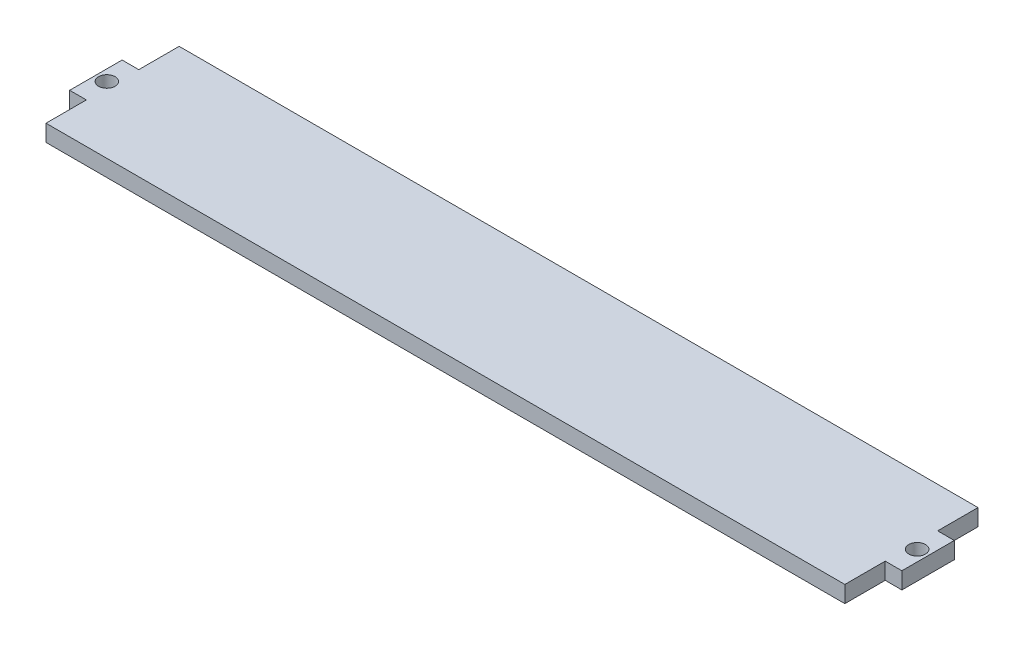
ISO-10303-21;
HEADER;
FILE_DESCRIPTION(('STEP AP214'),'2;1');
FILE_NAME('part.step','',(''),(''),'','','');
FILE_SCHEMA(('AUTOMOTIVE_DESIGN { 1 0 10303 214 1 1 1 1 }'));
ENDSEC;
DATA;
#1=APPLICATION_CONTEXT('core data for automotive mechanical design processes');
#2=APPLICATION_PROTOCOL_DEFINITION('international standard','automotive_design',2000,#1);
#3=PRODUCT_CONTEXT('',#1,'mechanical');
#4=PRODUCT('Part','Part','',(#3));
#5=PRODUCT_RELATED_PRODUCT_CATEGORY('part','',(#4));
#6=PRODUCT_DEFINITION_FORMATION('','',#4);
#7=PRODUCT_DEFINITION_CONTEXT('part definition',#1,'design');
#8=PRODUCT_DEFINITION('design','',#6,#7);
#9=PRODUCT_DEFINITION_SHAPE('','',#8);
#10=(LENGTH_UNIT() NAMED_UNIT(*) SI_UNIT(.MILLI.,.METRE.));
#11=(NAMED_UNIT(*) PLANE_ANGLE_UNIT() SI_UNIT($,.RADIAN.));
#12=(NAMED_UNIT(*) SI_UNIT($,.STERADIAN.) SOLID_ANGLE_UNIT());
#13=UNCERTAINTY_MEASURE_WITH_UNIT(LENGTH_MEASURE(1.E-05),#10,'distance_accuracy_value','');
#14=(GEOMETRIC_REPRESENTATION_CONTEXT(3) GLOBAL_UNCERTAINTY_ASSIGNED_CONTEXT((#13)) GLOBAL_UNIT_ASSIGNED_CONTEXT((#10,
#11,#12)) REPRESENTATION_CONTEXT('',''));
#15=CARTESIAN_POINT('',(0.,0.,0.));
#16=DIRECTION('',(0.,0.,1.));
#17=DIRECTION('',(1.,0.,0.));
#18=AXIS2_PLACEMENT_3D('',#15,#16,#17);
#19=CARTESIAN_POINT('',(76.2,3.18,-12.7));
#20=DIRECTION('',(-1.,0.,0.));
#21=DIRECTION('',(0.,0.,1.));
#22=AXIS2_PLACEMENT_3D('',#19,#20,#21);
#23=PLANE('',#22);
#24=DIRECTION('',(0.,1.,0.));
#25=VECTOR('',#24,1.);
#26=CARTESIAN_POINT('',(76.2,3.18,-5.));
#27=LINE('',#26,#25);
#28=CARTESIAN_POINT('',(76.2,0.,-5.));
#29=VERTEX_POINT('',#28);
#30=CARTESIAN_POINT('',(76.2,3.18,-5.));
#31=VERTEX_POINT('',#30);
#32=EDGE_CURVE('E154',#29,#31,#27,.T.);
#33=ORIENTED_EDGE('',*,*,#32,.F.);
#34=DIRECTION('',(0.,0.,-1.));
#35=VECTOR('',#34,1.);
#36=CARTESIAN_POINT('',(76.2,0.,-12.7));
#37=LINE('',#36,#35);
#38=CARTESIAN_POINT('',(76.2,0.,-12.7));
#39=VERTEX_POINT('',#38);
#40=EDGE_CURVE('E220',#29,#39,#37,.T.);
#41=ORIENTED_EDGE('',*,*,#40,.T.);
#42=DIRECTION('',(0.,-1.,0.));
#43=VECTOR('',#42,1.);
#44=CARTESIAN_POINT('',(76.2,3.18,-12.7));
#45=LINE('',#44,#43);
#46=CARTESIAN_POINT('',(76.2,3.18,-12.7));
#47=VERTEX_POINT('',#46);
#48=EDGE_CURVE('E230',#47,#39,#45,.T.);
#49=ORIENTED_EDGE('',*,*,#48,.F.);
#50=DIRECTION('',(0.,0.,-1.));
#51=VECTOR('',#50,1.);
#52=CARTESIAN_POINT('',(76.2,3.18,-12.7));
#53=LINE('',#52,#51);
#54=EDGE_CURVE('E55',#31,#47,#53,.T.);
#55=ORIENTED_EDGE('',*,*,#54,.F.);
#56=EDGE_LOOP('',(#33,#41,#49,#55));
#57=FACE_BOUND('',#56,.T.);
#58=ADVANCED_FACE('F39',(#57),#23,.F.);
#59=DIRECTION('',(0.,-1.,0.));
#60=VECTOR('',#59,1.);
#61=CARTESIAN_POINT('',(76.2,3.18,5.));
#62=LINE('',#61,#60);
#63=CARTESIAN_POINT('',(76.2,3.18,5.));
#64=VERTEX_POINT('',#63);
#65=CARTESIAN_POINT('',(76.2,0.,5.));
#66=VERTEX_POINT('',#65);
#67=EDGE_CURVE('E63',#64,#66,#62,.T.);
#68=ORIENTED_EDGE('',*,*,#67,.F.);
#69=CARTESIAN_POINT('',(76.2,3.18,12.7));
#70=VERTEX_POINT('',#69);
#71=EDGE_CURVE('E207',#70,#64,#53,.T.);
#72=ORIENTED_EDGE('',*,*,#71,.F.);
#73=DIRECTION('',(0.,-1.,0.));
#74=VECTOR('',#73,1.);
#75=CARTESIAN_POINT('',(76.2,3.18,12.7));
#76=LINE('',#75,#74);
#77=CARTESIAN_POINT('',(76.2,0.,12.7));
#78=VERTEX_POINT('',#77);
#79=EDGE_CURVE('E48',#70,#78,#76,.T.);
#80=ORIENTED_EDGE('',*,*,#79,.T.);
#81=EDGE_CURVE('E221',#78,#66,#37,.T.);
#82=ORIENTED_EDGE('',*,*,#81,.T.);
#83=EDGE_LOOP('',(#68,#72,#80,#82));
#84=FACE_BOUND('',#83,.T.);
#85=ADVANCED_FACE('F237',(#84),#23,.F.);
#86=CARTESIAN_POINT('',(-76.2,3.18,-12.7));
#87=DIRECTION('',(1.,0.,0.));
#88=DIRECTION('',(0.,0.,-1.));
#89=AXIS2_PLACEMENT_3D('',#86,#87,#88);
#90=PLANE('',#89);
#91=DIRECTION('',(0.,-1.,0.));
#92=VECTOR('',#91,1.);
#93=CARTESIAN_POINT('',(-76.2,3.18,-5.));
#94=LINE('',#93,#92);
#95=CARTESIAN_POINT('',(-76.2,3.18,-5.));
#96=VERTEX_POINT('',#95);
#97=CARTESIAN_POINT('',(-76.2,0.,-5.));
#98=VERTEX_POINT('',#97);
#99=EDGE_CURVE('E160',#96,#98,#94,.T.);
#100=ORIENTED_EDGE('',*,*,#99,.F.);
#101=DIRECTION('',(0.,0.,1.));
#102=VECTOR('',#101,1.);
#103=CARTESIAN_POINT('',(-76.2,3.18,-12.7));
#104=LINE('',#103,#102);
#105=CARTESIAN_POINT('',(-76.2,3.18,-12.7));
#106=VERTEX_POINT('',#105);
#107=EDGE_CURVE('E200',#106,#96,#104,.T.);
#108=ORIENTED_EDGE('',*,*,#107,.F.);
#109=DIRECTION('',(0.,-1.,0.));
#110=VECTOR('',#109,1.);
#111=CARTESIAN_POINT('',(-76.2,3.18,-12.7));
#112=LINE('',#111,#110);
#113=CARTESIAN_POINT('',(-76.2,0.,-12.7));
#114=VERTEX_POINT('',#113);
#115=EDGE_CURVE('E213',#106,#114,#112,.T.);
#116=ORIENTED_EDGE('',*,*,#115,.T.);
#117=DIRECTION('',(0.,0.,1.));
#118=VECTOR('',#117,1.);
#119=CARTESIAN_POINT('',(-76.2,0.,-12.7));
#120=LINE('',#119,#118);
#121=EDGE_CURVE('E214',#114,#98,#120,.T.);
#122=ORIENTED_EDGE('',*,*,#121,.T.);
#123=EDGE_LOOP('',(#100,#108,#116,#122));
#124=FACE_BOUND('',#123,.T.);
#125=ADVANCED_FACE('F307',(#124),#90,.F.);
#126=CARTESIAN_POINT('',(-76.2,3.18,5.));
#127=VERTEX_POINT('',#126);
#128=CARTESIAN_POINT('',(-76.2,3.18,12.7));
#129=VERTEX_POINT('',#128);
#130=EDGE_CURVE('E204',#127,#129,#104,.T.);
#131=ORIENTED_EDGE('',*,*,#130,.F.);
#132=DIRECTION('',(0.,-1.,0.));
#133=VECTOR('',#132,1.);
#134=CARTESIAN_POINT('',(-76.2,3.18,5.));
#135=LINE('',#134,#133);
#136=CARTESIAN_POINT('',(-76.2,0.,5.));
#137=VERTEX_POINT('',#136);
#138=EDGE_CURVE('E156',#127,#137,#135,.T.);
#139=ORIENTED_EDGE('',*,*,#138,.T.);
#140=CARTESIAN_POINT('',(-76.2,0.,12.7));
#141=VERTEX_POINT('',#140);
#142=EDGE_CURVE('E188',#137,#141,#120,.T.);
#143=ORIENTED_EDGE('',*,*,#142,.T.);
#144=DIRECTION('',(0.,-1.,0.));
#145=VECTOR('',#144,1.);
#146=CARTESIAN_POINT('',(-76.2,3.18,12.7));
#147=LINE('',#146,#145);
#148=EDGE_CURVE('E11',#129,#141,#147,.T.);
#149=ORIENTED_EDGE('',*,*,#148,.F.);
#150=EDGE_LOOP('',(#131,#139,#143,#149));
#151=FACE_BOUND('',#150,.T.);
#152=ADVANCED_FACE('F41',(#151),#90,.F.);
#153=CARTESIAN_POINT('',(76.2,3.18,12.7));
#154=DIRECTION('',(0.,0.,-1.));
#155=DIRECTION('',(-1.,0.,0.));
#156=AXIS2_PLACEMENT_3D('',#153,#154,#155);
#157=PLANE('',#156);
#158=DIRECTION('',(1.,0.,0.));
#159=VECTOR('',#158,1.);
#160=CARTESIAN_POINT('',(76.2,0.,12.7));
#161=LINE('',#160,#159);
#162=EDGE_CURVE('E217',#141,#78,#161,.T.);
#163=ORIENTED_EDGE('',*,*,#162,.T.);
#164=ORIENTED_EDGE('',*,*,#79,.F.);
#165=DIRECTION('',(1.,0.,0.));
#166=VECTOR('',#165,1.);
#167=CARTESIAN_POINT('',(76.2,3.18,12.7));
#168=LINE('',#167,#166);
#169=EDGE_CURVE('E203',#129,#70,#168,.T.);
#170=ORIENTED_EDGE('',*,*,#169,.F.);
#171=ORIENTED_EDGE('',*,*,#148,.T.);
#172=EDGE_LOOP('',(#163,#164,#170,#171));
#173=FACE_BOUND('',#172,.T.);
#174=ADVANCED_FACE('F310',(#173),#157,.F.);
#175=CARTESIAN_POINT('',(76.2,3.18,-12.7));
#176=DIRECTION('',(0.,0.,1.));
#177=DIRECTION('',(1.,0.,0.));
#178=AXIS2_PLACEMENT_3D('',#175,#176,#177);
#179=PLANE('',#178);
#180=DIRECTION('',(-1.,0.,0.));
#181=VECTOR('',#180,1.);
#182=CARTESIAN_POINT('',(76.2,0.,-12.7));
#183=LINE('',#182,#181);
#184=EDGE_CURVE('E224',#39,#114,#183,.T.);
#185=ORIENTED_EDGE('',*,*,#184,.T.);
#186=ORIENTED_EDGE('',*,*,#115,.F.);
#187=DIRECTION('',(-1.,0.,0.));
#188=VECTOR('',#187,1.);
#189=CARTESIAN_POINT('',(76.2,3.18,-12.7));
#190=LINE('',#189,#188);
#191=EDGE_CURVE('E210',#47,#106,#190,.T.);
#192=ORIENTED_EDGE('',*,*,#191,.F.);
#193=ORIENTED_EDGE('',*,*,#48,.T.);
#194=EDGE_LOOP('',(#185,#186,#192,#193));
#195=FACE_BOUND('',#194,.T.);
#196=ADVANCED_FACE('F289',(#195),#179,.F.);
#197=CARTESIAN_POINT('',(0.,3.18,0.));
#198=DIRECTION('',(0.,-1.,0.));
#199=DIRECTION('',(0.,0.,-1.));
#200=AXIS2_PLACEMENT_3D('',#197,#198,#199);
#201=PLANE('',#200);
#202=CARTESIAN_POINT('',(77.29,3.18,0.));
#203=DIRECTION('',(0.,1.,0.));
#204=DIRECTION('',(0.,0.,1.));
#205=AXIS2_PLACEMENT_3D('',#202,#203,#204);
#206=CIRCLE('',#205,1.59000000000001);
#207=CARTESIAN_POINT('',(77.29,3.18,1.59000000000001));
#208=VERTEX_POINT('',#207);
#209=EDGE_CURVE('E270',#208,#208,#206,.T.);
#210=ORIENTED_EDGE('',*,*,#209,.F.);
#211=EDGE_LOOP('',(#210));
#212=FACE_BOUND('',#211,.T.);
#213=CARTESIAN_POINT('',(-77.29,3.18,0.));
#214=DIRECTION('',(0.,1.,0.));
#215=DIRECTION('',(0.,0.,-1.));
#216=AXIS2_PLACEMENT_3D('',#213,#214,#215);
#217=CIRCLE('',#216,1.59000000000001);
#218=CARTESIAN_POINT('',(-77.29,3.18,-1.59000000000001));
#219=VERTEX_POINT('',#218);
#220=EDGE_CURVE('E262',#219,#219,#217,.T.);
#221=ORIENTED_EDGE('',*,*,#220,.F.);
#222=EDGE_LOOP('',(#221));
#223=FACE_BOUND('',#222,.T.);
#224=ORIENTED_EDGE('',*,*,#107,.T.);
#225=DIRECTION('',(1.,0.,0.));
#226=VECTOR('',#225,1.);
#227=CARTESIAN_POINT('',(-79.38,3.18,-5.));
#228=LINE('',#227,#226);
#229=CARTESIAN_POINT('',(-79.38,3.18,-5.));
#230=VERTEX_POINT('',#229);
#231=EDGE_CURVE('E184',#230,#96,#228,.T.);
#232=ORIENTED_EDGE('',*,*,#231,.F.);
#233=DIRECTION('',(0.,0.,1.));
#234=VECTOR('',#233,1.);
#235=CARTESIAN_POINT('',(-79.38,3.18,-5.));
#236=LINE('',#235,#234);
#237=CARTESIAN_POINT('',(-79.38,3.18,5.));
#238=VERTEX_POINT('',#237);
#239=EDGE_CURVE('E166',#230,#238,#236,.T.);
#240=ORIENTED_EDGE('',*,*,#239,.T.);
#241=DIRECTION('',(1.,0.,0.));
#242=VECTOR('',#241,1.);
#243=CARTESIAN_POINT('',(-79.38,3.18,5.));
#244=LINE('',#243,#242);
#245=EDGE_CURVE('E179',#238,#127,#244,.T.);
#246=ORIENTED_EDGE('',*,*,#245,.T.);
#247=ORIENTED_EDGE('',*,*,#130,.T.);
#248=ORIENTED_EDGE('',*,*,#169,.T.);
#249=ORIENTED_EDGE('',*,*,#71,.T.);
#250=DIRECTION('',(-1.,0.,0.));
#251=VECTOR('',#250,1.);
#252=CARTESIAN_POINT('',(79.38,3.18,5.));
#253=LINE('',#252,#251);
#254=CARTESIAN_POINT('',(79.38,3.18,5.));
#255=VERTEX_POINT('',#254);
#256=EDGE_CURVE('E137',#255,#64,#253,.T.);
#257=ORIENTED_EDGE('',*,*,#256,.F.);
#258=DIRECTION('',(0.,0.,1.));
#259=VECTOR('',#258,1.);
#260=CARTESIAN_POINT('',(79.38,3.18,5.));
#261=LINE('',#260,#259);
#262=CARTESIAN_POINT('',(79.38,3.18,-5.));
#263=VERTEX_POINT('',#262);
#264=EDGE_CURVE('E129',#263,#255,#261,.T.);
#265=ORIENTED_EDGE('',*,*,#264,.F.);
#266=DIRECTION('',(-1.,0.,0.));
#267=VECTOR('',#266,1.);
#268=CARTESIAN_POINT('',(79.38,3.18,-5.));
#269=LINE('',#268,#267);
#270=EDGE_CURVE('E134',#263,#31,#269,.T.);
#271=ORIENTED_EDGE('',*,*,#270,.T.);
#272=ORIENTED_EDGE('',*,*,#54,.T.);
#273=ORIENTED_EDGE('',*,*,#191,.T.);
#274=EDGE_LOOP('',(#224,#232,#240,#246,#247,#248,#249,#257,#265,#271,#272,#273));
#275=FACE_BOUND('',#274,.T.);
#276=ADVANCED_FACE('F132',(#212,#223,#275),#201,.F.);
#277=CARTESIAN_POINT('',(0.,0.,0.));
#278=DIRECTION('',(0.,-1.,0.));
#279=DIRECTION('',(0.,0.,-1.));
#280=AXIS2_PLACEMENT_3D('',#277,#278,#279);
#281=PLANE('',#280);
#282=CARTESIAN_POINT('',(77.29,0.,0.));
#283=DIRECTION('',(0.,1.,0.));
#284=DIRECTION('',(0.,0.,1.));
#285=AXIS2_PLACEMENT_3D('',#282,#283,#284);
#286=CIRCLE('',#285,1.59000000000001);
#287=CARTESIAN_POINT('',(77.29,0.,1.59000000000001));
#288=VERTEX_POINT('',#287);
#289=EDGE_CURVE('E257',#288,#288,#286,.T.);
#290=ORIENTED_EDGE('',*,*,#289,.T.);
#291=EDGE_LOOP('',(#290));
#292=FACE_BOUND('',#291,.T.);
#293=CARTESIAN_POINT('',(-77.29,0.,0.));
#294=DIRECTION('',(0.,1.,0.));
#295=DIRECTION('',(0.,0.,-1.));
#296=AXIS2_PLACEMENT_3D('',#293,#294,#295);
#297=CIRCLE('',#296,1.59000000000001);
#298=CARTESIAN_POINT('',(-77.29,0.,-1.59000000000001));
#299=VERTEX_POINT('',#298);
#300=EDGE_CURVE('E266',#299,#299,#297,.T.);
#301=ORIENTED_EDGE('',*,*,#300,.T.);
#302=EDGE_LOOP('',(#301));
#303=FACE_BOUND('',#302,.T.);
#304=ORIENTED_EDGE('',*,*,#121,.F.);
#305=ORIENTED_EDGE('',*,*,#184,.F.);
#306=ORIENTED_EDGE('',*,*,#40,.F.);
#307=DIRECTION('',(-1.,0.,0.));
#308=VECTOR('',#307,1.);
#309=CARTESIAN_POINT('',(79.38,0.,-5.));
#310=LINE('',#309,#308);
#311=CARTESIAN_POINT('',(79.38,0.,-5.));
#312=VERTEX_POINT('',#311);
#313=EDGE_CURVE('E249',#312,#29,#310,.T.);
#314=ORIENTED_EDGE('',*,*,#313,.F.);
#315=DIRECTION('',(0.,0.,-1.));
#316=VECTOR('',#315,1.);
#317=CARTESIAN_POINT('',(79.38,0.,5.));
#318=LINE('',#317,#316);
#319=CARTESIAN_POINT('',(79.38,0.,5.));
#320=VERTEX_POINT('',#319);
#321=EDGE_CURVE('E147',#320,#312,#318,.T.);
#322=ORIENTED_EDGE('',*,*,#321,.F.);
#323=DIRECTION('',(-1.,0.,0.));
#324=VECTOR('',#323,1.);
#325=CARTESIAN_POINT('',(79.38,0.,5.));
#326=LINE('',#325,#324);
#327=EDGE_CURVE('E162',#320,#66,#326,.T.);
#328=ORIENTED_EDGE('',*,*,#327,.T.);
#329=ORIENTED_EDGE('',*,*,#81,.F.);
#330=ORIENTED_EDGE('',*,*,#162,.F.);
#331=ORIENTED_EDGE('',*,*,#142,.F.);
#332=DIRECTION('',(1.,0.,0.));
#333=VECTOR('',#332,1.);
#334=CARTESIAN_POINT('',(-79.38,0.,5.));
#335=LINE('',#334,#333);
#336=CARTESIAN_POINT('',(-79.38,0.,5.));
#337=VERTEX_POINT('',#336);
#338=EDGE_CURVE('E193',#337,#137,#335,.T.);
#339=ORIENTED_EDGE('',*,*,#338,.F.);
#340=DIRECTION('',(0.,0.,1.));
#341=VECTOR('',#340,1.);
#342=CARTESIAN_POINT('',(-79.38,0.,-5.));
#343=LINE('',#342,#341);
#344=CARTESIAN_POINT('',(-79.38,0.,-5.));
#345=VERTEX_POINT('',#344);
#346=EDGE_CURVE('E174',#345,#337,#343,.T.);
#347=ORIENTED_EDGE('',*,*,#346,.F.);
#348=DIRECTION('',(1.,0.,0.));
#349=VECTOR('',#348,1.);
#350=CARTESIAN_POINT('',(-79.38,0.,-5.));
#351=LINE('',#350,#349);
#352=EDGE_CURVE('E189',#345,#98,#351,.T.);
#353=ORIENTED_EDGE('',*,*,#352,.T.);
#354=EDGE_LOOP('',(#304,#305,#306,#314,#322,#328,#329,#330,#331,#339,#347,#353));
#355=FACE_BOUND('',#354,.T.);
#356=ADVANCED_FACE('F244',(#292,#303,#355),#281,.T.);
#357=CARTESIAN_POINT('',(-79.38,3.18,-5.));
#358=DIRECTION('',(0.,0.,1.));
#359=DIRECTION('',(1.,0.,0.));
#360=AXIS2_PLACEMENT_3D('',#357,#358,#359);
#361=PLANE('',#360);
#362=ORIENTED_EDGE('',*,*,#99,.T.);
#363=ORIENTED_EDGE('',*,*,#352,.F.);
#364=DIRECTION('',(0.,-1.,0.));
#365=VECTOR('',#364,1.);
#366=CARTESIAN_POINT('',(-79.38,3.18,-5.));
#367=LINE('',#366,#365);
#368=EDGE_CURVE('E177',#230,#345,#367,.T.);
#369=ORIENTED_EDGE('',*,*,#368,.F.);
#370=ORIENTED_EDGE('',*,*,#231,.T.);
#371=EDGE_LOOP('',(#362,#363,#369,#370));
#372=FACE_BOUND('',#371,.T.);
#373=ADVANCED_FACE('F333',(#372),#361,.F.);
#374=CARTESIAN_POINT('',(-79.38,3.18,5.));
#375=DIRECTION('',(0.,0.,1.));
#376=DIRECTION('',(1.,0.,0.));
#377=AXIS2_PLACEMENT_3D('',#374,#375,#376);
#378=PLANE('',#377);
#379=ORIENTED_EDGE('',*,*,#138,.F.);
#380=ORIENTED_EDGE('',*,*,#245,.F.);
#381=DIRECTION('',(0.,-1.,0.));
#382=VECTOR('',#381,1.);
#383=CARTESIAN_POINT('',(-79.38,3.18,5.));
#384=LINE('',#383,#382);
#385=EDGE_CURVE('E170',#238,#337,#384,.T.);
#386=ORIENTED_EDGE('',*,*,#385,.T.);
#387=ORIENTED_EDGE('',*,*,#338,.T.);
#388=EDGE_LOOP('',(#379,#380,#386,#387));
#389=FACE_BOUND('',#388,.T.);
#390=ADVANCED_FACE('F341',(#389),#378,.T.);
#391=CARTESIAN_POINT('',(-79.38,0.,0.));
#392=DIRECTION('',(1.,0.,0.));
#393=DIRECTION('',(0.,0.,-1.));
#394=AXIS2_PLACEMENT_3D('',#391,#392,#393);
#395=PLANE('',#394);
#396=ORIENTED_EDGE('',*,*,#239,.F.);
#397=ORIENTED_EDGE('',*,*,#368,.T.);
#398=ORIENTED_EDGE('',*,*,#346,.T.);
#399=ORIENTED_EDGE('',*,*,#385,.F.);
#400=EDGE_LOOP('',(#396,#397,#398,#399));
#401=FACE_BOUND('',#400,.T.);
#402=ADVANCED_FACE('F339',(#401),#395,.F.);
#403=CARTESIAN_POINT('',(79.38,3.18,-5.));
#404=DIRECTION('',(0.,0.,1.));
#405=DIRECTION('',(1.,0.,0.));
#406=AXIS2_PLACEMENT_3D('',#403,#404,#405);
#407=PLANE('',#406);
#408=ORIENTED_EDGE('',*,*,#32,.T.);
#409=ORIENTED_EDGE('',*,*,#270,.F.);
#410=DIRECTION('',(0.,1.,0.));
#411=VECTOR('',#410,1.);
#412=CARTESIAN_POINT('',(79.38,3.18,-5.));
#413=LINE('',#412,#411);
#414=EDGE_CURVE('E142',#312,#263,#413,.T.);
#415=ORIENTED_EDGE('',*,*,#414,.F.);
#416=ORIENTED_EDGE('',*,*,#313,.T.);
#417=EDGE_LOOP('',(#408,#409,#415,#416));
#418=FACE_BOUND('',#417,.T.);
#419=ADVANCED_FACE('F153',(#418),#407,.F.);
#420=CARTESIAN_POINT('',(79.38,3.18,5.));
#421=DIRECTION('',(0.,0.,-1.));
#422=DIRECTION('',(-1.,0.,0.));
#423=AXIS2_PLACEMENT_3D('',#420,#421,#422);
#424=PLANE('',#423);
#425=ORIENTED_EDGE('',*,*,#67,.T.);
#426=ORIENTED_EDGE('',*,*,#327,.F.);
#427=DIRECTION('',(0.,-1.,0.));
#428=VECTOR('',#427,1.);
#429=CARTESIAN_POINT('',(79.38,3.18,5.));
#430=LINE('',#429,#428);
#431=EDGE_CURVE('E141',#255,#320,#430,.T.);
#432=ORIENTED_EDGE('',*,*,#431,.F.);
#433=ORIENTED_EDGE('',*,*,#256,.T.);
#434=EDGE_LOOP('',(#425,#426,#432,#433));
#435=FACE_BOUND('',#434,.T.);
#436=ADVANCED_FACE('F299',(#435),#424,.F.);
#437=CARTESIAN_POINT('',(79.38,0.,0.));
#438=DIRECTION('',(1.,0.,0.));
#439=DIRECTION('',(0.,0.,-1.));
#440=AXIS2_PLACEMENT_3D('',#437,#438,#439);
#441=PLANE('',#440);
#442=ORIENTED_EDGE('',*,*,#414,.T.);
#443=ORIENTED_EDGE('',*,*,#264,.T.);
#444=ORIENTED_EDGE('',*,*,#431,.T.);
#445=ORIENTED_EDGE('',*,*,#321,.T.);
#446=EDGE_LOOP('',(#442,#443,#444,#445));
#447=FACE_BOUND('',#446,.T.);
#448=ADVANCED_FACE('F145',(#447),#441,.T.);
#449=CARTESIAN_POINT('',(-77.29,0.,0.));
#450=DIRECTION('',(0.,1.,0.));
#451=DIRECTION('',(0.,0.,1.));
#452=AXIS2_PLACEMENT_3D('',#449,#450,#451);
#453=CYLINDRICAL_SURFACE('',#452,1.59000000000001);
#454=ORIENTED_EDGE('',*,*,#300,.F.);
#455=EDGE_LOOP('',(#454));
#456=FACE_BOUND('',#455,.T.);
#457=ORIENTED_EDGE('',*,*,#220,.T.);
#458=EDGE_LOOP('',(#457));
#459=FACE_BOUND('',#458,.T.);
#460=ADVANCED_FACE('F283',(#456,#459),#453,.F.);
#461=CARTESIAN_POINT('',(77.29,0.,0.));
#462=DIRECTION('',(0.,1.,0.));
#463=DIRECTION('',(0.,0.,1.));
#464=AXIS2_PLACEMENT_3D('',#461,#462,#463);
#465=CYLINDRICAL_SURFACE('',#464,1.59000000000001);
#466=ORIENTED_EDGE('',*,*,#289,.F.);
#467=EDGE_LOOP('',(#466));
#468=FACE_BOUND('',#467,.T.);
#469=ORIENTED_EDGE('',*,*,#209,.T.);
#470=EDGE_LOOP('',(#469));
#471=FACE_BOUND('',#470,.T.);
#472=ADVANCED_FACE('F280',(#468,#471),#465,.F.);
#473=CLOSED_SHELL('',(#58,#85,#125,#152,#174,#196,#276,#356,#373,#390,#402,#419,#436,#448,#460,#472));
#474=MANIFOLD_SOLID_BREP('B2',#473);
#475=ADVANCED_BREP_SHAPE_REPRESENTATION('',(#18,#474),#14);
#476=SHAPE_DEFINITION_REPRESENTATION(#9,#475);
ENDSEC;
END-ISO-10303-21;
